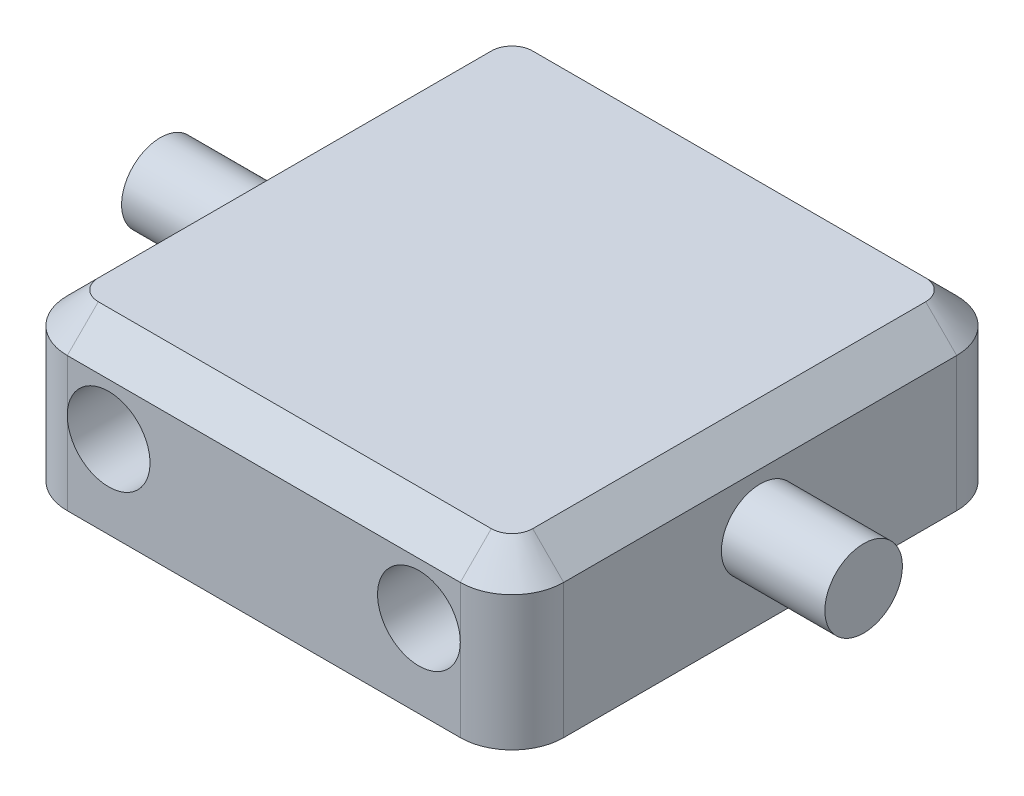
ISO-10303-21;
HEADER;
FILE_DESCRIPTION(('STEP AP214'),'2;1');
FILE_NAME('part.step','',(''),(''),'','','');
FILE_SCHEMA(('AUTOMOTIVE_DESIGN { 1 0 10303 214 1 1 1 1 }'));
ENDSEC;
DATA;
#1=APPLICATION_CONTEXT('core data for automotive mechanical design processes');
#2=APPLICATION_PROTOCOL_DEFINITION('international standard','automotive_design',2000,#1);
#3=PRODUCT_CONTEXT('',#1,'mechanical');
#4=PRODUCT('Part','Part','',(#3));
#5=PRODUCT_RELATED_PRODUCT_CATEGORY('part','',(#4));
#6=PRODUCT_DEFINITION_FORMATION('','',#4);
#7=PRODUCT_DEFINITION_CONTEXT('part definition',#1,'design');
#8=PRODUCT_DEFINITION('design','',#6,#7);
#9=PRODUCT_DEFINITION_SHAPE('','',#8);
#10=(LENGTH_UNIT() NAMED_UNIT(*) SI_UNIT(.MILLI.,.METRE.));
#11=(NAMED_UNIT(*) PLANE_ANGLE_UNIT() SI_UNIT($,.RADIAN.));
#12=(NAMED_UNIT(*) SI_UNIT($,.STERADIAN.) SOLID_ANGLE_UNIT());
#13=UNCERTAINTY_MEASURE_WITH_UNIT(LENGTH_MEASURE(1.E-05),#10,'distance_accuracy_value','');
#14=(GEOMETRIC_REPRESENTATION_CONTEXT(3) GLOBAL_UNCERTAINTY_ASSIGNED_CONTEXT((#13)) GLOBAL_UNIT_ASSIGNED_CONTEXT((#10,
#11,#12)) REPRESENTATION_CONTEXT('',''));
#15=CARTESIAN_POINT('',(0.,0.,0.));
#16=DIRECTION('',(0.,0.,1.));
#17=DIRECTION('',(1.,0.,0.));
#18=AXIS2_PLACEMENT_3D('',#15,#16,#17);
#19=CARTESIAN_POINT('',(23.9999999999999,16.,24.));
#20=DIRECTION('',(-1.,0.,0.));
#21=DIRECTION('',(0.,0.,1.));
#22=AXIS2_PLACEMENT_3D('',#19,#20,#21);
#23=PLANE('',#22);
#24=DIRECTION('',(0.,-1.,0.));
#25=VECTOR('',#24,1.);
#26=CARTESIAN_POINT('',(23.9999999999999,16.,-19.));
#27=LINE('',#26,#25);
#28=CARTESIAN_POINT('',(23.9999999999999,0.,-19.));
#29=VERTEX_POINT('',#28);
#30=CARTESIAN_POINT('',(23.9999999999999,13.,-19.));
#31=VERTEX_POINT('',#30);
#32=EDGE_CURVE('E162',#29,#31,#27,.F.);
#33=ORIENTED_EDGE('',*,*,#32,.T.);
#34=DIRECTION('',(0.,0.,1.));
#35=VECTOR('',#34,1.);
#36=CARTESIAN_POINT('',(23.9999999999999,13.,24.));
#37=LINE('',#36,#35);
#38=CARTESIAN_POINT('',(23.9999999999999,13.,19.));
#39=VERTEX_POINT('',#38);
#40=EDGE_CURVE('E11',#31,#39,#37,.T.);
#41=ORIENTED_EDGE('',*,*,#40,.T.);
#42=DIRECTION('',(0.,-1.,0.));
#43=VECTOR('',#42,1.);
#44=CARTESIAN_POINT('',(23.9999999999999,16.,19.));
#45=LINE('',#44,#43);
#46=CARTESIAN_POINT('',(23.9999999999999,0.,19.));
#47=VERTEX_POINT('',#46);
#48=EDGE_CURVE('E160',#39,#47,#45,.T.);
#49=ORIENTED_EDGE('',*,*,#48,.T.);
#50=DIRECTION('',(0.,0.,-1.));
#51=VECTOR('',#50,1.);
#52=CARTESIAN_POINT('',(23.9999999999999,0.,24.));
#53=LINE('',#52,#51);
#54=EDGE_CURVE('E255',#47,#29,#53,.T.);
#55=ORIENTED_EDGE('',*,*,#54,.T.);
#56=EDGE_LOOP('',(#33,#41,#49,#55));
#57=FACE_BOUND('',#56,.T.);
#58=CARTESIAN_POINT('',(23.9999999999999,8.,0.));
#59=DIRECTION('',(-1.,0.,0.));
#60=DIRECTION('',(0.,0.,1.));
#61=AXIS2_PLACEMENT_3D('',#58,#59,#60);
#62=CIRCLE('',#61,3.75);
#63=CARTESIAN_POINT('',(23.9999999999999,8.,3.75));
#64=VERTEX_POINT('',#63);
#65=EDGE_CURVE('E266',#64,#64,#62,.F.);
#66=ORIENTED_EDGE('',*,*,#65,.F.);
#67=EDGE_LOOP('',(#66));
#68=FACE_BOUND('',#67,.T.);
#69=ADVANCED_FACE('F33',(#57,#68),#23,.F.);
#70=CARTESIAN_POINT('',(-24.0000000000001,16.,-24.));
#71=DIRECTION('',(0.,0.,1.));
#72=DIRECTION('',(1.,0.,0.));
#73=AXIS2_PLACEMENT_3D('',#70,#71,#72);
#74=PLANE('',#73);
#75=DIRECTION('',(0.,-1.,0.));
#76=VECTOR('',#75,1.);
#77=CARTESIAN_POINT('',(-19.0000000000001,16.,-24.));
#78=LINE('',#77,#76);
#79=CARTESIAN_POINT('',(-19.0000000000001,8.,-24.));
#80=VERTEX_POINT('',#79);
#81=CARTESIAN_POINT('',(-19.0000000000001,13.,-24.));
#82=VERTEX_POINT('',#81);
#83=EDGE_CURVE('E150',#80,#82,#78,.F.);
#84=ORIENTED_EDGE('',*,*,#83,.T.);
#85=DIRECTION('',(1.,0.,0.));
#86=VECTOR('',#85,1.);
#87=CARTESIAN_POINT('',(-24.0000000000001,13.,-24.));
#88=LINE('',#87,#86);
#89=CARTESIAN_POINT('',(18.9999999999999,13.,-24.));
#90=VERTEX_POINT('',#89);
#91=EDGE_CURVE('E57',#82,#90,#88,.T.);
#92=ORIENTED_EDGE('',*,*,#91,.T.);
#93=DIRECTION('',(0.,-1.,0.));
#94=VECTOR('',#93,1.);
#95=CARTESIAN_POINT('',(18.9999999999999,16.,-24.));
#96=LINE('',#95,#94);
#97=CARTESIAN_POINT('',(18.9999999999999,8.,-24.));
#98=VERTEX_POINT('',#97);
#99=EDGE_CURVE('E134',#90,#98,#96,.T.);
#100=ORIENTED_EDGE('',*,*,#99,.T.);
#101=CARTESIAN_POINT('',(15.,8.,-24.));
#102=DIRECTION('',(0.,0.,1.));
#103=DIRECTION('',(1.,0.,0.));
#104=AXIS2_PLACEMENT_3D('',#101,#102,#103);
#105=CIRCLE('',#104,4.);
#106=EDGE_CURVE('E138',#98,#98,#105,.T.);
#107=ORIENTED_EDGE('',*,*,#106,.T.);
#108=DIRECTION('',(0.,-1.,0.));
#109=VECTOR('',#108,1.);
#110=CARTESIAN_POINT('',(18.9999999999999,16.,-24.));
#111=LINE('',#110,#109);
#112=CARTESIAN_POINT('',(18.9999999999999,0.,-24.));
#113=VERTEX_POINT('',#112);
#114=EDGE_CURVE('E141',#98,#113,#111,.T.);
#115=ORIENTED_EDGE('',*,*,#114,.T.);
#116=DIRECTION('',(-1.,0.,0.));
#117=VECTOR('',#116,1.);
#118=CARTESIAN_POINT('',(-24.0000000000001,0.,-24.));
#119=LINE('',#118,#117);
#120=CARTESIAN_POINT('',(-19.0000000000001,0.,-24.));
#121=VERTEX_POINT('',#120);
#122=EDGE_CURVE('E258',#113,#121,#119,.T.);
#123=ORIENTED_EDGE('',*,*,#122,.T.);
#124=DIRECTION('',(0.,-1.,0.));
#125=VECTOR('',#124,1.);
#126=CARTESIAN_POINT('',(-19.0000000000001,16.,-24.));
#127=LINE('',#126,#125);
#128=EDGE_CURVE('E148',#121,#80,#127,.F.);
#129=ORIENTED_EDGE('',*,*,#128,.T.);
#130=CARTESIAN_POINT('',(-15.,8.,-24.));
#131=DIRECTION('',(0.,0.,1.));
#132=DIRECTION('',(1.,0.,0.));
#133=AXIS2_PLACEMENT_3D('',#130,#131,#132);
#134=CIRCLE('',#133,4.);
#135=EDGE_CURVE('E252',#80,#80,#134,.T.);
#136=ORIENTED_EDGE('',*,*,#135,.T.);
#137=EDGE_LOOP('',(#84,#92,#100,#107,#115,#123,#129,#136));
#138=FACE_BOUND('',#137,.T.);
#139=ADVANCED_FACE('F136',(#138),#74,.F.);
#140=CARTESIAN_POINT('',(-24.0000000000001,16.,24.));
#141=DIRECTION('',(1.,0.,0.));
#142=DIRECTION('',(0.,0.,-1.));
#143=AXIS2_PLACEMENT_3D('',#140,#141,#142);
#144=PLANE('',#143);
#145=CARTESIAN_POINT('',(-23.9999999999999,8.,0.));
#146=DIRECTION('',(1.,0.,0.));
#147=DIRECTION('',(0.,0.,-1.));
#148=AXIS2_PLACEMENT_3D('',#145,#146,#147);
#149=CIRCLE('',#148,3.75);
#150=CARTESIAN_POINT('',(-23.9999999999999,8.,-3.75));
#151=VERTEX_POINT('',#150);
#152=EDGE_CURVE('E229',#151,#151,#149,.T.);
#153=ORIENTED_EDGE('',*,*,#152,.T.);
#154=EDGE_LOOP('',(#153));
#155=FACE_BOUND('',#154,.T.);
#156=DIRECTION('',(0.,-1.,0.));
#157=VECTOR('',#156,1.);
#158=CARTESIAN_POINT('',(-24.0000000000001,16.,19.));
#159=LINE('',#158,#157);
#160=CARTESIAN_POINT('',(-24.0000000000001,0.,19.));
#161=VERTEX_POINT('',#160);
#162=CARTESIAN_POINT('',(-24.0000000000001,13.,19.));
#163=VERTEX_POINT('',#162);
#164=EDGE_CURVE('E173',#161,#163,#159,.F.);
#165=ORIENTED_EDGE('',*,*,#164,.T.);
#166=DIRECTION('',(0.,0.,-1.));
#167=VECTOR('',#166,1.);
#168=CARTESIAN_POINT('',(-24.0000000000001,13.,24.));
#169=LINE('',#168,#167);
#170=CARTESIAN_POINT('',(-24.0000000000001,13.,-19.));
#171=VERTEX_POINT('',#170);
#172=EDGE_CURVE('E202',#163,#171,#169,.T.);
#173=ORIENTED_EDGE('',*,*,#172,.T.);
#174=DIRECTION('',(0.,-1.,0.));
#175=VECTOR('',#174,1.);
#176=CARTESIAN_POINT('',(-24.0000000000001,16.,-19.));
#177=LINE('',#176,#175);
#178=CARTESIAN_POINT('',(-24.0000000000001,0.,-19.));
#179=VERTEX_POINT('',#178);
#180=EDGE_CURVE('E176',#171,#179,#177,.T.);
#181=ORIENTED_EDGE('',*,*,#180,.T.);
#182=DIRECTION('',(0.,0.,1.));
#183=VECTOR('',#182,1.);
#184=CARTESIAN_POINT('',(-24.0000000000001,0.,24.));
#185=LINE('',#184,#183);
#186=EDGE_CURVE('E260',#179,#161,#185,.T.);
#187=ORIENTED_EDGE('',*,*,#186,.T.);
#188=EDGE_LOOP('',(#165,#173,#181,#187));
#189=FACE_BOUND('',#188,.T.);
#190=ADVANCED_FACE('F322',(#155,#189),#144,.F.);
#191=CARTESIAN_POINT('',(-24.0000000000001,16.,24.));
#192=DIRECTION('',(0.,0.,-1.));
#193=DIRECTION('',(-1.,0.,0.));
#194=AXIS2_PLACEMENT_3D('',#191,#192,#193);
#195=PLANE('',#194);
#196=DIRECTION('',(0.,-1.,0.));
#197=VECTOR('',#196,1.);
#198=CARTESIAN_POINT('',(18.9999999999999,16.,24.));
#199=LINE('',#198,#197);
#200=CARTESIAN_POINT('',(18.9999999999999,8.,24.));
#201=VERTEX_POINT('',#200);
#202=CARTESIAN_POINT('',(18.9999999999999,13.,24.));
#203=VERTEX_POINT('',#202);
#204=EDGE_CURVE('E168',#201,#203,#199,.F.);
#205=ORIENTED_EDGE('',*,*,#204,.T.);
#206=DIRECTION('',(-1.,0.,0.));
#207=VECTOR('',#206,1.);
#208=CARTESIAN_POINT('',(-24.0000000000001,13.,24.));
#209=LINE('',#208,#207);
#210=CARTESIAN_POINT('',(-19.0000000000001,13.,24.));
#211=VERTEX_POINT('',#210);
#212=EDGE_CURVE('E198',#203,#211,#209,.T.);
#213=ORIENTED_EDGE('',*,*,#212,.T.);
#214=DIRECTION('',(0.,-1.,0.));
#215=VECTOR('',#214,1.);
#216=CARTESIAN_POINT('',(-19.0000000000001,16.,24.));
#217=LINE('',#216,#215);
#218=CARTESIAN_POINT('',(-19.0000000000001,8.,24.));
#219=VERTEX_POINT('',#218);
#220=EDGE_CURVE('E166',#211,#219,#217,.T.);
#221=ORIENTED_EDGE('',*,*,#220,.T.);
#222=CARTESIAN_POINT('',(-15.,8.,24.));
#223=DIRECTION('',(0.,0.,1.));
#224=DIRECTION('',(1.,0.,0.));
#225=AXIS2_PLACEMENT_3D('',#222,#223,#224);
#226=CIRCLE('',#225,4.);
#227=EDGE_CURVE('E249',#219,#219,#226,.T.);
#228=ORIENTED_EDGE('',*,*,#227,.F.);
#229=DIRECTION('',(0.,-1.,0.));
#230=VECTOR('',#229,1.);
#231=CARTESIAN_POINT('',(-19.0000000000001,16.,24.));
#232=LINE('',#231,#230);
#233=CARTESIAN_POINT('',(-19.0000000000001,0.,24.));
#234=VERTEX_POINT('',#233);
#235=EDGE_CURVE('E164',#219,#234,#232,.T.);
#236=ORIENTED_EDGE('',*,*,#235,.T.);
#237=DIRECTION('',(1.,0.,0.));
#238=VECTOR('',#237,1.);
#239=CARTESIAN_POINT('',(-24.0000000000001,0.,24.));
#240=LINE('',#239,#238);
#241=CARTESIAN_POINT('',(18.9999999999999,0.,24.));
#242=VERTEX_POINT('',#241);
#243=EDGE_CURVE('E263',#234,#242,#240,.T.);
#244=ORIENTED_EDGE('',*,*,#243,.T.);
#245=DIRECTION('',(0.,-1.,0.));
#246=VECTOR('',#245,1.);
#247=CARTESIAN_POINT('',(18.9999999999999,16.,24.));
#248=LINE('',#247,#246);
#249=EDGE_CURVE('E171',#242,#201,#248,.F.);
#250=ORIENTED_EDGE('',*,*,#249,.T.);
#251=CARTESIAN_POINT('',(15.,8.,24.));
#252=DIRECTION('',(0.,0.,1.));
#253=DIRECTION('',(1.,0.,0.));
#254=AXIS2_PLACEMENT_3D('',#251,#252,#253);
#255=CIRCLE('',#254,4.);
#256=EDGE_CURVE('E245',#201,#201,#255,.T.);
#257=ORIENTED_EDGE('',*,*,#256,.F.);
#258=EDGE_LOOP('',(#205,#213,#221,#228,#236,#244,#250,#257));
#259=FACE_BOUND('',#258,.T.);
#260=ADVANCED_FACE('F306',(#259),#195,.F.);
#261=CARTESIAN_POINT('',(0.,16.,0.));
#262=DIRECTION('',(0.,-1.,0.));
#263=DIRECTION('',(0.,0.,-1.));
#264=AXIS2_PLACEMENT_3D('',#261,#262,#263);
#265=PLANE('',#264);
#266=DIRECTION('',(1.,0.,0.));
#267=VECTOR('',#266,1.);
#268=CARTESIAN_POINT('',(0.,16.,21.));
#269=LINE('',#268,#267);
#270=CARTESIAN_POINT('',(-19.0000000000001,16.,21.));
#271=VERTEX_POINT('',#270);
#272=CARTESIAN_POINT('',(18.9999999999999,16.,21.));
#273=VERTEX_POINT('',#272);
#274=EDGE_CURVE('E190',#271,#273,#269,.T.);
#275=ORIENTED_EDGE('',*,*,#274,.T.);
#276=CARTESIAN_POINT('',(18.9999999999999,16.,19.));
#277=DIRECTION('',(0.,-1.,0.));
#278=DIRECTION('',(0.,0.,-1.));
#279=AXIS2_PLACEMENT_3D('',#276,#277,#278);
#280=CIRCLE('',#279,2.00000000000001);
#281=CARTESIAN_POINT('',(20.9999999999999,16.,19.));
#282=VERTEX_POINT('',#281);
#283=EDGE_CURVE('E192',#273,#282,#280,.F.);
#284=ORIENTED_EDGE('',*,*,#283,.T.);
#285=DIRECTION('',(0.,0.,-1.));
#286=VECTOR('',#285,1.);
#287=CARTESIAN_POINT('',(20.9999999999999,16.,0.));
#288=LINE('',#287,#286);
#289=CARTESIAN_POINT('',(20.9999999999999,16.,-19.));
#290=VERTEX_POINT('',#289);
#291=EDGE_CURVE('E178',#282,#290,#288,.T.);
#292=ORIENTED_EDGE('',*,*,#291,.T.);
#293=CARTESIAN_POINT('',(18.9999999999999,16.,-19.));
#294=DIRECTION('',(0.,-1.,0.));
#295=DIRECTION('',(0.,0.,-1.));
#296=AXIS2_PLACEMENT_3D('',#293,#294,#295);
#297=CIRCLE('',#296,2.00000000000001);
#298=CARTESIAN_POINT('',(18.9999999999999,16.,-21.));
#299=VERTEX_POINT('',#298);
#300=EDGE_CURVE('E180',#290,#299,#297,.F.);
#301=ORIENTED_EDGE('',*,*,#300,.T.);
#302=DIRECTION('',(-1.,0.,0.));
#303=VECTOR('',#302,1.);
#304=CARTESIAN_POINT('',(0.,16.,-21.));
#305=LINE('',#304,#303);
#306=CARTESIAN_POINT('',(-19.0000000000001,16.,-21.));
#307=VERTEX_POINT('',#306);
#308=EDGE_CURVE('E182',#299,#307,#305,.T.);
#309=ORIENTED_EDGE('',*,*,#308,.T.);
#310=CARTESIAN_POINT('',(-19.0000000000001,16.,-19.));
#311=DIRECTION('',(0.,-1.,0.));
#312=DIRECTION('',(0.,0.,-1.));
#313=AXIS2_PLACEMENT_3D('',#310,#311,#312);
#314=CIRCLE('',#313,2.00000000000001);
#315=CARTESIAN_POINT('',(-21.0000000000001,16.,-19.));
#316=VERTEX_POINT('',#315);
#317=EDGE_CURVE('E184',#307,#316,#314,.F.);
#318=ORIENTED_EDGE('',*,*,#317,.T.);
#319=DIRECTION('',(0.,0.,1.));
#320=VECTOR('',#319,1.);
#321=CARTESIAN_POINT('',(-21.0000000000001,16.,0.));
#322=LINE('',#321,#320);
#323=CARTESIAN_POINT('',(-21.0000000000001,16.,19.));
#324=VERTEX_POINT('',#323);
#325=EDGE_CURVE('E186',#316,#324,#322,.T.);
#326=ORIENTED_EDGE('',*,*,#325,.T.);
#327=CARTESIAN_POINT('',(-19.0000000000001,16.,19.));
#328=DIRECTION('',(0.,-1.,0.));
#329=DIRECTION('',(0.,0.,-1.));
#330=AXIS2_PLACEMENT_3D('',#327,#328,#329);
#331=CIRCLE('',#330,2.00000000000001);
#332=EDGE_CURVE('E188',#324,#271,#331,.F.);
#333=ORIENTED_EDGE('',*,*,#332,.T.);
#334=EDGE_LOOP('',(#275,#284,#292,#301,#309,#318,#326,#333));
#335=FACE_BOUND('',#334,.T.);
#336=ADVANCED_FACE('F342',(#335),#265,.F.);
#337=CARTESIAN_POINT('',(0.,0.,0.));
#338=DIRECTION('',(0.,-1.,0.));
#339=DIRECTION('',(0.,0.,-1.));
#340=AXIS2_PLACEMENT_3D('',#337,#338,#339);
#341=PLANE('',#340);
#342=ORIENTED_EDGE('',*,*,#122,.F.);
#343=CARTESIAN_POINT('',(18.9999999999999,0.,-19.));
#344=DIRECTION('',(0.,-1.,0.));
#345=DIRECTION('',(0.,0.,-1.));
#346=AXIS2_PLACEMENT_3D('',#343,#344,#345);
#347=CIRCLE('',#346,5.);
#348=EDGE_CURVE('E145',#113,#29,#347,.T.);
#349=ORIENTED_EDGE('',*,*,#348,.T.);
#350=ORIENTED_EDGE('',*,*,#54,.F.);
#351=CARTESIAN_POINT('',(18.9999999999999,0.,19.));
#352=DIRECTION('',(0.,-1.,0.));
#353=DIRECTION('',(0.,0.,-1.));
#354=AXIS2_PLACEMENT_3D('',#351,#352,#353);
#355=CIRCLE('',#354,5.);
#356=EDGE_CURVE('E157',#47,#242,#355,.T.);
#357=ORIENTED_EDGE('',*,*,#356,.T.);
#358=ORIENTED_EDGE('',*,*,#243,.F.);
#359=CARTESIAN_POINT('',(-19.0000000000001,0.,19.));
#360=DIRECTION('',(0.,-1.,0.));
#361=DIRECTION('',(0.,0.,-1.));
#362=AXIS2_PLACEMENT_3D('',#359,#360,#361);
#363=CIRCLE('',#362,5.);
#364=EDGE_CURVE('E140',#234,#161,#363,.T.);
#365=ORIENTED_EDGE('',*,*,#364,.T.);
#366=ORIENTED_EDGE('',*,*,#186,.F.);
#367=CARTESIAN_POINT('',(-19.0000000000001,0.,-19.));
#368=DIRECTION('',(0.,-1.,0.));
#369=DIRECTION('',(0.,0.,-1.));
#370=AXIS2_PLACEMENT_3D('',#367,#368,#369);
#371=CIRCLE('',#370,5.);
#372=EDGE_CURVE('E155',#179,#121,#371,.T.);
#373=ORIENTED_EDGE('',*,*,#372,.T.);
#374=EDGE_LOOP('',(#342,#349,#350,#357,#358,#365,#366,#373));
#375=FACE_BOUND('',#374,.T.);
#376=ADVANCED_FACE('F327',(#375),#341,.T.);
#377=CARTESIAN_POINT('',(-15.,8.,-76.));
#378=DIRECTION('',(0.,0.,1.));
#379=DIRECTION('',(1.,0.,0.));
#380=AXIS2_PLACEMENT_3D('',#377,#378,#379);
#381=CYLINDRICAL_SURFACE('',#380,4.);
#382=ORIENTED_EDGE('',*,*,#227,.T.);
#383=EDGE_LOOP('',(#382));
#384=FACE_BOUND('',#383,.T.);
#385=ORIENTED_EDGE('',*,*,#135,.F.);
#386=EDGE_LOOP('',(#385));
#387=FACE_BOUND('',#386,.T.);
#388=ADVANCED_FACE('F330',(#384,#387),#381,.F.);
#389=CARTESIAN_POINT('',(15.,8.,-76.));
#390=DIRECTION('',(0.,0.,1.));
#391=DIRECTION('',(1.,0.,0.));
#392=AXIS2_PLACEMENT_3D('',#389,#390,#391);
#393=CYLINDRICAL_SURFACE('',#392,4.);
#394=ORIENTED_EDGE('',*,*,#256,.T.);
#395=EDGE_LOOP('',(#394));
#396=FACE_BOUND('',#395,.T.);
#397=ORIENTED_EDGE('',*,*,#106,.F.);
#398=EDGE_LOOP('',(#397));
#399=FACE_BOUND('',#398,.T.);
#400=ADVANCED_FACE('F333',(#396,#399),#393,.F.);
#401=CARTESIAN_POINT('',(33.9999999999999,8.,0.));
#402=DIRECTION('',(-1.,0.,0.));
#403=DIRECTION('',(0.,0.,1.));
#404=AXIS2_PLACEMENT_3D('',#401,#402,#403);
#405=CYLINDRICAL_SURFACE('',#404,3.75);
#406=CARTESIAN_POINT('',(33.9999999999999,8.,0.));
#407=DIRECTION('',(1.,0.,0.));
#408=DIRECTION('',(0.,0.,-1.));
#409=AXIS2_PLACEMENT_3D('',#406,#407,#408);
#410=CIRCLE('',#409,3.75);
#411=CARTESIAN_POINT('',(33.9999999999999,8.,-3.75));
#412=VERTEX_POINT('',#411);
#413=EDGE_CURVE('E240',#412,#412,#410,.T.);
#414=ORIENTED_EDGE('',*,*,#413,.F.);
#415=EDGE_LOOP('',(#414));
#416=FACE_BOUND('',#415,.T.);
#417=ORIENTED_EDGE('',*,*,#65,.T.);
#418=EDGE_LOOP('',(#417));
#419=FACE_BOUND('',#418,.T.);
#420=ADVANCED_FACE('F339',(#416,#419),#405,.T.);
#421=CARTESIAN_POINT('',(33.9999999999999,8.,0.));
#422=DIRECTION('',(1.,0.,0.));
#423=DIRECTION('',(0.,0.,-1.));
#424=AXIS2_PLACEMENT_3D('',#421,#422,#423);
#425=PLANE('',#424);
#426=ORIENTED_EDGE('',*,*,#413,.T.);
#427=EDGE_LOOP('',(#426));
#428=FACE_BOUND('',#427,.T.);
#429=ADVANCED_FACE('F411',(#428),#425,.T.);
#430=CARTESIAN_POINT('',(-33.9999999999999,8.,0.));
#431=DIRECTION('',(1.,0.,0.));
#432=DIRECTION('',(0.,0.,-1.));
#433=AXIS2_PLACEMENT_3D('',#430,#431,#432);
#434=CYLINDRICAL_SURFACE('',#433,3.75);
#435=CARTESIAN_POINT('',(-33.9999999999999,8.,0.));
#436=DIRECTION('',(1.,0.,0.));
#437=DIRECTION('',(0.,0.,-1.));
#438=AXIS2_PLACEMENT_3D('',#435,#436,#437);
#439=CIRCLE('',#438,3.75);
#440=CARTESIAN_POINT('',(-33.9999999999999,8.,-3.75));
#441=VERTEX_POINT('',#440);
#442=EDGE_CURVE('E235',#441,#441,#439,.T.);
#443=ORIENTED_EDGE('',*,*,#442,.T.);
#444=EDGE_LOOP('',(#443));
#445=FACE_BOUND('',#444,.T.);
#446=ORIENTED_EDGE('',*,*,#152,.F.);
#447=EDGE_LOOP('',(#446));
#448=FACE_BOUND('',#447,.T.);
#449=ADVANCED_FACE('F402',(#445,#448),#434,.T.);
#450=CARTESIAN_POINT('',(-33.9999999999999,8.,0.));
#451=DIRECTION('',(-1.,0.,0.));
#452=DIRECTION('',(0.,0.,-1.));
#453=AXIS2_PLACEMENT_3D('',#450,#451,#452);
#454=PLANE('',#453);
#455=ORIENTED_EDGE('',*,*,#442,.F.);
#456=EDGE_LOOP('',(#455));
#457=FACE_BOUND('',#456,.T.);
#458=ADVANCED_FACE('F355',(#457),#454,.T.);
#459=CARTESIAN_POINT('',(18.9999999999999,16.,-19.));
#460=DIRECTION('',(0.,-1.,0.));
#461=DIRECTION('',(0.,0.,-1.));
#462=AXIS2_PLACEMENT_3D('',#459,#460,#461);
#463=CYLINDRICAL_SURFACE('',#462,5.);
#464=ORIENTED_EDGE('',*,*,#99,.F.);
#465=CARTESIAN_POINT('',(18.9999999999999,13.,-19.));
#466=DIRECTION('',(0.,-1.,0.));
#467=DIRECTION('',(0.,0.,-1.));
#468=AXIS2_PLACEMENT_3D('',#465,#466,#467);
#469=CIRCLE('',#468,5.);
#470=EDGE_CURVE('E42',#90,#31,#469,.T.);
#471=ORIENTED_EDGE('',*,*,#470,.T.);
#472=ORIENTED_EDGE('',*,*,#32,.F.);
#473=ORIENTED_EDGE('',*,*,#348,.F.);
#474=ORIENTED_EDGE('',*,*,#114,.F.);
#475=EDGE_LOOP('',(#464,#471,#472,#473,#474));
#476=FACE_BOUND('',#475,.T.);
#477=ADVANCED_FACE('F144',(#476),#463,.T.);
#478=CARTESIAN_POINT('',(18.9999999999999,16.,19.));
#479=DIRECTION('',(0.,-1.,0.));
#480=DIRECTION('',(0.,0.,-1.));
#481=AXIS2_PLACEMENT_3D('',#478,#479,#480);
#482=CYLINDRICAL_SURFACE('',#481,5.);
#483=ORIENTED_EDGE('',*,*,#48,.F.);
#484=CARTESIAN_POINT('',(18.9999999999999,13.,19.));
#485=DIRECTION('',(0.,-1.,0.));
#486=DIRECTION('',(0.,0.,-1.));
#487=AXIS2_PLACEMENT_3D('',#484,#485,#486);
#488=CIRCLE('',#487,5.);
#489=EDGE_CURVE('E195',#39,#203,#488,.T.);
#490=ORIENTED_EDGE('',*,*,#489,.T.);
#491=ORIENTED_EDGE('',*,*,#204,.F.);
#492=ORIENTED_EDGE('',*,*,#249,.F.);
#493=ORIENTED_EDGE('',*,*,#356,.F.);
#494=EDGE_LOOP('',(#483,#490,#491,#492,#493));
#495=FACE_BOUND('',#494,.T.);
#496=ADVANCED_FACE('F291',(#495),#482,.T.);
#497=CARTESIAN_POINT('',(-19.0000000000001,16.,-19.));
#498=DIRECTION('',(0.,-1.,0.));
#499=DIRECTION('',(0.,0.,-1.));
#500=AXIS2_PLACEMENT_3D('',#497,#498,#499);
#501=CYLINDRICAL_SURFACE('',#500,5.);
#502=ORIENTED_EDGE('',*,*,#180,.F.);
#503=CARTESIAN_POINT('',(-19.0000000000001,13.,-19.));
#504=DIRECTION('',(0.,-1.,0.));
#505=DIRECTION('',(0.,0.,-1.));
#506=AXIS2_PLACEMENT_3D('',#503,#504,#505);
#507=CIRCLE('',#506,5.);
#508=EDGE_CURVE('E204',#171,#82,#507,.T.);
#509=ORIENTED_EDGE('',*,*,#508,.T.);
#510=ORIENTED_EDGE('',*,*,#83,.F.);
#511=ORIENTED_EDGE('',*,*,#128,.F.);
#512=ORIENTED_EDGE('',*,*,#372,.F.);
#513=EDGE_LOOP('',(#502,#509,#510,#511,#512));
#514=FACE_BOUND('',#513,.T.);
#515=ADVANCED_FACE('F324',(#514),#501,.T.);
#516=CARTESIAN_POINT('',(-19.0000000000001,16.,19.));
#517=DIRECTION('',(0.,-1.,0.));
#518=DIRECTION('',(0.,0.,-1.));
#519=AXIS2_PLACEMENT_3D('',#516,#517,#518);
#520=CYLINDRICAL_SURFACE('',#519,5.);
#521=ORIENTED_EDGE('',*,*,#220,.F.);
#522=CARTESIAN_POINT('',(-19.0000000000001,13.,19.));
#523=DIRECTION('',(0.,-1.,0.));
#524=DIRECTION('',(0.,0.,-1.));
#525=AXIS2_PLACEMENT_3D('',#522,#523,#524);
#526=CIRCLE('',#525,5.);
#527=EDGE_CURVE('E200',#211,#163,#526,.T.);
#528=ORIENTED_EDGE('',*,*,#527,.T.);
#529=ORIENTED_EDGE('',*,*,#164,.F.);
#530=ORIENTED_EDGE('',*,*,#364,.F.);
#531=ORIENTED_EDGE('',*,*,#235,.F.);
#532=EDGE_LOOP('',(#521,#528,#529,#530,#531));
#533=FACE_BOUND('',#532,.T.);
#534=ADVANCED_FACE('F312',(#533),#520,.T.);
#535=CARTESIAN_POINT('',(-19.0000000000001,16.,-19.));
#536=DIRECTION('',(0.,-1.,0.));
#537=DIRECTION('',(0.,0.,-1.));
#538=AXIS2_PLACEMENT_3D('',#535,#536,#537);
#539=CONICAL_SURFACE('',#538,2.00000000000001,0.785398163397447);
#540=DIRECTION('',(0.,0.707106781186548,0.707106781186547));
#541=VECTOR('',#540,1.);
#542=CARTESIAN_POINT('',(-19.0000000000001,13.,-24.));
#543=LINE('',#542,#541);
#544=EDGE_CURVE('E223',#82,#307,#543,.T.);
#545=ORIENTED_EDGE('',*,*,#544,.F.);
#546=ORIENTED_EDGE('',*,*,#508,.F.);
#547=DIRECTION('',(-0.707106781186547,-0.707106781186548,0.));
#548=VECTOR('',#547,1.);
#549=CARTESIAN_POINT('',(-21.0000000000001,16.,-19.));
#550=LINE('',#549,#548);
#551=EDGE_CURVE('E37',#316,#171,#550,.T.);
#552=ORIENTED_EDGE('',*,*,#551,.F.);
#553=ORIENTED_EDGE('',*,*,#317,.F.);
#554=EDGE_LOOP('',(#545,#546,#552,#553));
#555=FACE_BOUND('',#554,.T.);
#556=ADVANCED_FACE('F35',(#555),#539,.T.);
#557=CARTESIAN_POINT('',(-21.0000000000001,16.,0.));
#558=DIRECTION('',(0.707106781186548,-0.707106781186547,0.));
#559=DIRECTION('',(0.,0.,1.));
#560=AXIS2_PLACEMENT_3D('',#557,#558,#559);
#561=PLANE('',#560);
#562=ORIENTED_EDGE('',*,*,#551,.T.);
#563=ORIENTED_EDGE('',*,*,#172,.F.);
#564=DIRECTION('',(-0.707106781186547,-0.707106781186548,0.));
#565=VECTOR('',#564,1.);
#566=CARTESIAN_POINT('',(-21.0000000000001,16.,19.));
#567=LINE('',#566,#565);
#568=EDGE_CURVE('E221',#324,#163,#567,.T.);
#569=ORIENTED_EDGE('',*,*,#568,.F.);
#570=ORIENTED_EDGE('',*,*,#325,.F.);
#571=EDGE_LOOP('',(#562,#563,#569,#570));
#572=FACE_BOUND('',#571,.T.);
#573=ADVANCED_FACE('F319',(#572),#561,.F.);
#574=CARTESIAN_POINT('',(0.,16.,-21.));
#575=DIRECTION('',(0.,-0.707106781186547,0.707106781186548));
#576=DIRECTION('',(-1.,0.,0.));
#577=AXIS2_PLACEMENT_3D('',#574,#575,#576);
#578=PLANE('',#577);
#579=ORIENTED_EDGE('',*,*,#544,.T.);
#580=ORIENTED_EDGE('',*,*,#308,.F.);
#581=DIRECTION('',(0.,0.707106781186548,0.707106781186547));
#582=VECTOR('',#581,1.);
#583=CARTESIAN_POINT('',(18.9999999999999,13.,-24.));
#584=LINE('',#583,#582);
#585=EDGE_CURVE('E218',#90,#299,#584,.T.);
#586=ORIENTED_EDGE('',*,*,#585,.F.);
#587=ORIENTED_EDGE('',*,*,#91,.F.);
#588=EDGE_LOOP('',(#579,#580,#586,#587));
#589=FACE_BOUND('',#588,.T.);
#590=ADVANCED_FACE('F275',(#589),#578,.F.);
#591=CARTESIAN_POINT('',(-19.0000000000001,16.,19.));
#592=DIRECTION('',(0.,-1.,0.));
#593=DIRECTION('',(0.,0.,-1.));
#594=AXIS2_PLACEMENT_3D('',#591,#592,#593);
#595=CONICAL_SURFACE('',#594,2.00000000000001,0.785398163397447);
#596=ORIENTED_EDGE('',*,*,#568,.T.);
#597=ORIENTED_EDGE('',*,*,#527,.F.);
#598=DIRECTION('',(0.,-0.707106781186548,0.707106781186547));
#599=VECTOR('',#598,1.);
#600=CARTESIAN_POINT('',(-19.0000000000001,16.,21.));
#601=LINE('',#600,#599);
#602=EDGE_CURVE('E215',#271,#211,#601,.T.);
#603=ORIENTED_EDGE('',*,*,#602,.F.);
#604=ORIENTED_EDGE('',*,*,#332,.F.);
#605=EDGE_LOOP('',(#596,#597,#603,#604));
#606=FACE_BOUND('',#605,.T.);
#607=ADVANCED_FACE('F316',(#606),#595,.T.);
#608=CARTESIAN_POINT('',(18.9999999999999,16.,-19.));
#609=DIRECTION('',(0.,-1.,0.));
#610=DIRECTION('',(0.,0.,-1.));
#611=AXIS2_PLACEMENT_3D('',#608,#609,#610);
#612=CONICAL_SURFACE('',#611,2.00000000000001,0.785398163397447);
#613=ORIENTED_EDGE('',*,*,#585,.T.);
#614=ORIENTED_EDGE('',*,*,#300,.F.);
#615=DIRECTION('',(-0.707106781186547,0.707106781186548,0.));
#616=VECTOR('',#615,1.);
#617=CARTESIAN_POINT('',(23.9999999999999,13.,-19.));
#618=LINE('',#617,#616);
#619=EDGE_CURVE('E212',#31,#290,#618,.T.);
#620=ORIENTED_EDGE('',*,*,#619,.F.);
#621=ORIENTED_EDGE('',*,*,#470,.F.);
#622=EDGE_LOOP('',(#613,#614,#620,#621));
#623=FACE_BOUND('',#622,.T.);
#624=ADVANCED_FACE('F279',(#623),#612,.T.);
#625=CARTESIAN_POINT('',(0.,16.,21.));
#626=DIRECTION('',(0.,-0.707106781186547,-0.707106781186548));
#627=DIRECTION('',(1.,0.,0.));
#628=AXIS2_PLACEMENT_3D('',#625,#626,#627);
#629=PLANE('',#628);
#630=ORIENTED_EDGE('',*,*,#602,.T.);
#631=ORIENTED_EDGE('',*,*,#212,.F.);
#632=DIRECTION('',(0.,-0.707106781186548,0.707106781186547));
#633=VECTOR('',#632,1.);
#634=CARTESIAN_POINT('',(18.9999999999999,16.,21.));
#635=LINE('',#634,#633);
#636=EDGE_CURVE('E210',#273,#203,#635,.T.);
#637=ORIENTED_EDGE('',*,*,#636,.F.);
#638=ORIENTED_EDGE('',*,*,#274,.F.);
#639=EDGE_LOOP('',(#630,#631,#637,#638));
#640=FACE_BOUND('',#639,.T.);
#641=ADVANCED_FACE('F302',(#640),#629,.F.);
#642=CARTESIAN_POINT('',(20.9999999999999,16.,0.));
#643=DIRECTION('',(-0.707106781186548,-0.707106781186547,0.));
#644=DIRECTION('',(0.,0.,-1.));
#645=AXIS2_PLACEMENT_3D('',#642,#643,#644);
#646=PLANE('',#645);
#647=ORIENTED_EDGE('',*,*,#619,.T.);
#648=ORIENTED_EDGE('',*,*,#291,.F.);
#649=DIRECTION('',(-0.707106781186547,0.707106781186548,0.));
#650=VECTOR('',#649,1.);
#651=CARTESIAN_POINT('',(23.9999999999999,13.,19.));
#652=LINE('',#651,#650);
#653=EDGE_CURVE('E208',#39,#282,#652,.T.);
#654=ORIENTED_EDGE('',*,*,#653,.F.);
#655=ORIENTED_EDGE('',*,*,#40,.F.);
#656=EDGE_LOOP('',(#647,#648,#654,#655));
#657=FACE_BOUND('',#656,.T.);
#658=ADVANCED_FACE('F284',(#657),#646,.F.);
#659=CARTESIAN_POINT('',(18.9999999999999,16.,19.));
#660=DIRECTION('',(0.,-1.,0.));
#661=DIRECTION('',(0.,0.,-1.));
#662=AXIS2_PLACEMENT_3D('',#659,#660,#661);
#663=CONICAL_SURFACE('',#662,2.00000000000001,0.785398163397447);
#664=ORIENTED_EDGE('',*,*,#636,.T.);
#665=ORIENTED_EDGE('',*,*,#489,.F.);
#666=ORIENTED_EDGE('',*,*,#653,.T.);
#667=ORIENTED_EDGE('',*,*,#283,.F.);
#668=EDGE_LOOP('',(#664,#665,#666,#667));
#669=FACE_BOUND('',#668,.T.);
#670=ADVANCED_FACE('F296',(#669),#663,.T.);
#671=CLOSED_SHELL('',(#69,#139,#190,#260,#336,#376,#388,#400,#420,#429,#449,#458,#477,#496,#515,
#534,#556,#573,#590,#607,#624,#641,#658,#670));
#672=MANIFOLD_SOLID_BREP('B2',#671);
#673=ADVANCED_BREP_SHAPE_REPRESENTATION('',(#18,#672),#14);
#674=SHAPE_DEFINITION_REPRESENTATION(#9,#673);
ENDSEC;
END-ISO-10303-21;
